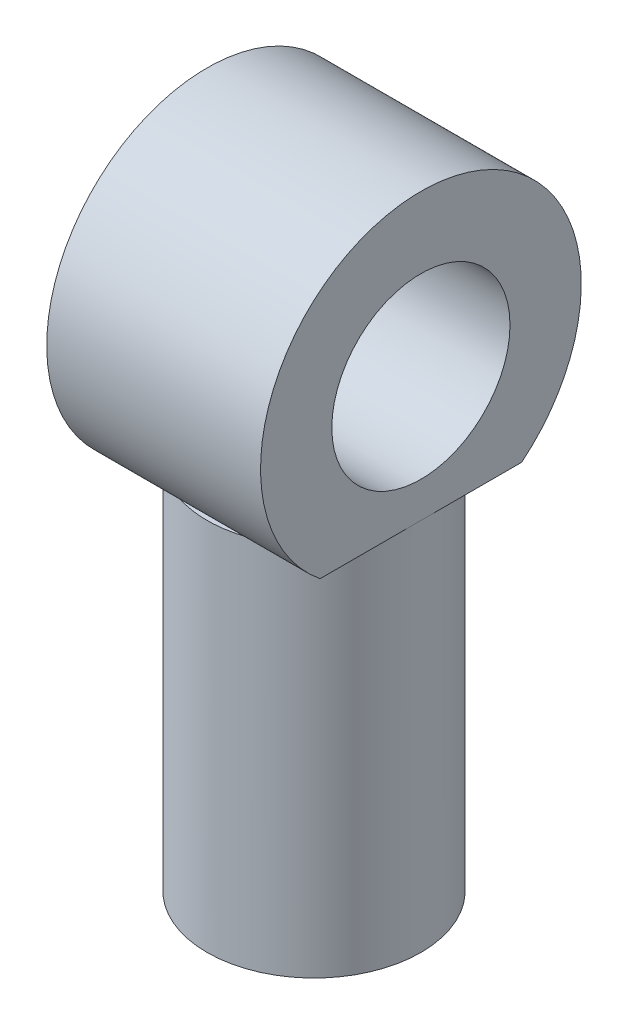
ISO-10303-21;
HEADER;
FILE_DESCRIPTION(('STEP AP214'),'2;1');
FILE_NAME('part.step','',(''),(''),'','','');
FILE_SCHEMA(('AUTOMOTIVE_DESIGN { 1 0 10303 214 1 1 1 1 }'));
ENDSEC;
DATA;
#1=APPLICATION_CONTEXT('core data for automotive mechanical design processes');
#2=APPLICATION_PROTOCOL_DEFINITION('international standard','automotive_design',2000,#1);
#3=PRODUCT_CONTEXT('',#1,'mechanical');
#4=PRODUCT('Part','Part','',(#3));
#5=PRODUCT_RELATED_PRODUCT_CATEGORY('part','',(#4));
#6=PRODUCT_DEFINITION_FORMATION('','',#4);
#7=PRODUCT_DEFINITION_CONTEXT('part definition',#1,'design');
#8=PRODUCT_DEFINITION('design','',#6,#7);
#9=PRODUCT_DEFINITION_SHAPE('','',#8);
#10=(LENGTH_UNIT() NAMED_UNIT(*) SI_UNIT(.MILLI.,.METRE.));
#11=(NAMED_UNIT(*) PLANE_ANGLE_UNIT() SI_UNIT($,.RADIAN.));
#12=(NAMED_UNIT(*) SI_UNIT($,.STERADIAN.) SOLID_ANGLE_UNIT());
#13=UNCERTAINTY_MEASURE_WITH_UNIT(LENGTH_MEASURE(1.E-05),#10,'distance_accuracy_value','');
#14=(GEOMETRIC_REPRESENTATION_CONTEXT(3) GLOBAL_UNCERTAINTY_ASSIGNED_CONTEXT((#13)) GLOBAL_UNIT_ASSIGNED_CONTEXT((#10,
#11,#12)) REPRESENTATION_CONTEXT('',''));
#15=CARTESIAN_POINT('',(0.,0.,0.));
#16=DIRECTION('',(0.,0.,1.));
#17=DIRECTION('',(1.,0.,0.));
#18=AXIS2_PLACEMENT_3D('',#15,#16,#17);
#19=CARTESIAN_POINT('',(0.,10.,0.));
#20=DIRECTION('',(0.,-1.,0.));
#21=DIRECTION('',(0.,0.,-1.));
#22=AXIS2_PLACEMENT_3D('',#19,#20,#21);
#23=CYLINDRICAL_SURFACE('',#22,3.);
#24=CARTESIAN_POINT('',(0.,0.,0.));
#25=DIRECTION('',(0.,1.,0.));
#26=DIRECTION('',(0.,0.,1.));
#27=AXIS2_PLACEMENT_3D('',#24,#25,#26);
#28=CIRCLE('',#27,3.);
#29=CARTESIAN_POINT('',(0.,0.,3.));
#30=VERTEX_POINT('',#29);
#31=EDGE_CURVE('E13',#30,#30,#28,.T.);
#32=ORIENTED_EDGE('',*,*,#31,.T.);
#33=EDGE_LOOP('',(#32));
#34=FACE_BOUND('',#33,.T.);
#35=CARTESIAN_POINT('',(0.,10.5,0.));
#36=DIRECTION('',(0.,1.,0.));
#37=DIRECTION('',(0.,0.,1.));
#38=AXIS2_PLACEMENT_3D('',#35,#36,#37);
#39=CIRCLE('',#38,3.);
#40=CARTESIAN_POINT('',(-0.999999999999999,10.5,2.82842712474619));
#41=VERTEX_POINT('',#40);
#42=CARTESIAN_POINT('',(0.999999999999999,10.5,2.82842712474619));
#43=VERTEX_POINT('',#42);
#44=EDGE_CURVE('E155',#41,#43,#39,.T.);
#45=ORIENTED_EDGE('',*,*,#44,.F.);
#46=CARTESIAN_POINT('',(-3.,10.5,0.));
#47=VERTEX_POINT('',#46);
#48=EDGE_CURVE('E167',#47,#41,#39,.T.);
#49=ORIENTED_EDGE('',*,*,#48,.F.);
#50=CARTESIAN_POINT('',(-0.999999999999992,10.5,-2.82842712474619));
#51=VERTEX_POINT('',#50);
#52=EDGE_CURVE('E391',#51,#47,#39,.T.);
#53=ORIENTED_EDGE('',*,*,#52,.F.);
#54=CARTESIAN_POINT('',(0.999999999999992,10.5,-2.82842712474619));
#55=VERTEX_POINT('',#54);
#56=EDGE_CURVE('E389',#55,#51,#39,.T.);
#57=ORIENTED_EDGE('',*,*,#56,.F.);
#58=CARTESIAN_POINT('',(3.,10.5,0.));
#59=VERTEX_POINT('',#58);
#60=EDGE_CURVE('E157',#59,#55,#39,.T.);
#61=ORIENTED_EDGE('',*,*,#60,.F.);
#62=EDGE_CURVE('E109',#43,#59,#39,.T.);
#63=ORIENTED_EDGE('',*,*,#62,.F.);
#64=EDGE_LOOP('',(#45,#49,#53,#57,#61,#63));
#65=FACE_BOUND('',#64,.T.);
#66=ADVANCED_FACE('F94',(#34,#65),#23,.T.);
#67=CARTESIAN_POINT('',(0.,0.,0.));
#68=DIRECTION('',(0.,1.,0.));
#69=DIRECTION('',(0.,0.,1.));
#70=AXIS2_PLACEMENT_3D('',#67,#68,#69);
#71=PLANE('',#70);
#72=CARTESIAN_POINT('',(0.,0.,0.));
#73=DIRECTION('',(0.,-1.,0.));
#74=DIRECTION('',(0.,0.,-1.));
#75=AXIS2_PLACEMENT_3D('',#72,#73,#74);
#76=CIRCLE('',#75,1.55);
#77=CARTESIAN_POINT('',(0.,0.,-1.55));
#78=VERTEX_POINT('',#77);
#79=EDGE_CURVE('E176',#78,#78,#76,.T.);
#80=ORIENTED_EDGE('',*,*,#79,.F.);
#81=EDGE_LOOP('',(#80));
#82=FACE_BOUND('',#81,.T.);
#83=ORIENTED_EDGE('',*,*,#31,.F.);
#84=EDGE_LOOP('',(#83));
#85=FACE_BOUND('',#84,.T.);
#86=ADVANCED_FACE('F189',(#82,#85),#71,.F.);
#87=CARTESIAN_POINT('',(0.,9.,0.));
#88=DIRECTION('',(0.,-1.,0.));
#89=DIRECTION('',(0.,0.,-1.));
#90=AXIS2_PLACEMENT_3D('',#87,#88,#89);
#91=CYLINDRICAL_SURFACE('',#90,1.55);
#92=CARTESIAN_POINT('',(0.,9.,0.));
#93=DIRECTION('',(0.,-1.,0.));
#94=DIRECTION('',(0.,0.,-1.));
#95=AXIS2_PLACEMENT_3D('',#92,#93,#94);
#96=CIRCLE('',#95,1.55);
#97=CARTESIAN_POINT('',(0.,9.,-1.55));
#98=VERTEX_POINT('',#97);
#99=EDGE_CURVE('E102',#98,#98,#96,.T.);
#100=ORIENTED_EDGE('',*,*,#99,.F.);
#101=EDGE_LOOP('',(#100));
#102=FACE_BOUND('',#101,.T.);
#103=ORIENTED_EDGE('',*,*,#79,.T.);
#104=EDGE_LOOP('',(#103));
#105=FACE_BOUND('',#104,.T.);
#106=ADVANCED_FACE('F187',(#102,#105),#91,.F.);
#107=CARTESIAN_POINT('',(0.,9.,0.));
#108=DIRECTION('',(0.,-1.,0.));
#109=DIRECTION('',(0.,0.,-1.));
#110=AXIS2_PLACEMENT_3D('',#107,#108,#109);
#111=PLANE('',#110);
#112=ORIENTED_EDGE('',*,*,#99,.T.);
#113=EDGE_LOOP('',(#112));
#114=FACE_BOUND('',#113,.T.);
#115=ADVANCED_FACE('F209',(#114),#111,.T.);
#116=CARTESIAN_POINT('',(0.,10.5,0.));
#117=DIRECTION('',(0.,1.,0.));
#118=DIRECTION('',(0.,0.,1.));
#119=AXIS2_PLACEMENT_3D('',#116,#117,#118);
#120=PLANE('',#119);
#121=DIRECTION('',(1.,0.,0.));
#122=VECTOR('',#121,1.);
#123=CARTESIAN_POINT('',(-3.,10.5,-2.82842712474619));
#124=LINE('',#123,#122);
#125=CARTESIAN_POINT('',(-3.,10.5,-2.82842712474619));
#126=VERTEX_POINT('',#125);
#127=EDGE_CURVE('E177',#126,#51,#124,.T.);
#128=ORIENTED_EDGE('',*,*,#127,.T.);
#129=ORIENTED_EDGE('',*,*,#52,.T.);
#130=DIRECTION('',(0.,0.,1.));
#131=VECTOR('',#130,1.);
#132=CARTESIAN_POINT('',(-3.,10.5,0.));
#133=LINE('',#132,#131);
#134=EDGE_CURVE('E150',#126,#47,#133,.T.);
#135=ORIENTED_EDGE('',*,*,#134,.F.);
#136=EDGE_LOOP('',(#128,#129,#135));
#137=FACE_BOUND('',#136,.T.);
#138=ADVANCED_FACE('F217',(#137),#120,.F.);
#139=DIRECTION('',(1.,0.,0.));
#140=VECTOR('',#139,1.);
#141=CARTESIAN_POINT('',(-3.,10.5,2.82842712474619));
#142=LINE('',#141,#140);
#143=CARTESIAN_POINT('',(-3.,10.5,2.82842712474619));
#144=VERTEX_POINT('',#143);
#145=EDGE_CURVE('E117',#144,#41,#142,.T.);
#146=ORIENTED_EDGE('',*,*,#145,.F.);
#147=EDGE_CURVE('E359',#47,#144,#133,.T.);
#148=ORIENTED_EDGE('',*,*,#147,.F.);
#149=ORIENTED_EDGE('',*,*,#48,.T.);
#150=EDGE_LOOP('',(#146,#148,#149));
#151=FACE_BOUND('',#150,.T.);
#152=ADVANCED_FACE('F224',(#151),#120,.F.);
#153=DIRECTION('',(1.,0.,0.));
#154=VECTOR('',#153,1.);
#155=CARTESIAN_POINT('',(-3.,10.5,2.82842712474619));
#156=LINE('',#155,#154);
#157=CARTESIAN_POINT('',(3.,10.5,2.82842712474619));
#158=VERTEX_POINT('',#157);
#159=EDGE_CURVE('E140',#158,#43,#156,.F.);
#160=ORIENTED_EDGE('',*,*,#159,.T.);
#161=ORIENTED_EDGE('',*,*,#62,.T.);
#162=DIRECTION('',(0.,0.,1.));
#163=VECTOR('',#162,1.);
#164=CARTESIAN_POINT('',(3.,10.5,0.));
#165=LINE('',#164,#163);
#166=EDGE_CURVE('E143',#59,#158,#165,.T.);
#167=ORIENTED_EDGE('',*,*,#166,.T.);
#168=EDGE_LOOP('',(#160,#161,#167));
#169=FACE_BOUND('',#168,.T.);
#170=ADVANCED_FACE('F141',(#169),#120,.F.);
#171=CARTESIAN_POINT('',(3.,10.5,-2.82842712474619));
#172=VERTEX_POINT('',#171);
#173=EDGE_CURVE('E382',#172,#59,#165,.T.);
#174=ORIENTED_EDGE('',*,*,#173,.T.);
#175=ORIENTED_EDGE('',*,*,#60,.T.);
#176=DIRECTION('',(1.,0.,0.));
#177=VECTOR('',#176,1.);
#178=CARTESIAN_POINT('',(-3.,10.5,-2.82842712474619));
#179=LINE('',#178,#177);
#180=EDGE_CURVE('E166',#55,#172,#179,.T.);
#181=ORIENTED_EDGE('',*,*,#180,.T.);
#182=EDGE_LOOP('',(#174,#175,#181));
#183=FACE_BOUND('',#182,.T.);
#184=ADVANCED_FACE('F227',(#183),#120,.F.);
#185=CARTESIAN_POINT('',(-3.,14.,0.));
#186=DIRECTION('',(1.,0.,0.));
#187=DIRECTION('',(0.,0.,-1.));
#188=AXIS2_PLACEMENT_3D('',#185,#186,#187);
#189=CYLINDRICAL_SURFACE('',#188,2.5);
#190=CARTESIAN_POINT('',(-3.,14.,0.));
#191=DIRECTION('',(1.,0.,0.));
#192=DIRECTION('',(0.,0.,-1.));
#193=AXIS2_PLACEMENT_3D('',#190,#191,#192);
#194=CIRCLE('',#193,2.5);
#195=CARTESIAN_POINT('',(-3.,14.,-2.5));
#196=VERTEX_POINT('',#195);
#197=EDGE_CURVE('E356',#196,#196,#194,.T.);
#198=ORIENTED_EDGE('',*,*,#197,.F.);
#199=EDGE_LOOP('',(#198));
#200=FACE_BOUND('',#199,.T.);
#201=CARTESIAN_POINT('',(3.,14.,0.));
#202=DIRECTION('',(1.,0.,0.));
#203=DIRECTION('',(0.,0.,-1.));
#204=AXIS2_PLACEMENT_3D('',#201,#202,#203);
#205=CIRCLE('',#204,2.5);
#206=CARTESIAN_POINT('',(3.,14.,-2.5));
#207=VERTEX_POINT('',#206);
#208=EDGE_CURVE('E149',#207,#207,#205,.T.);
#209=ORIENTED_EDGE('',*,*,#208,.T.);
#210=EDGE_LOOP('',(#209));
#211=FACE_BOUND('',#210,.T.);
#212=ADVANCED_FACE('F243',(#200,#211),#189,.F.);
#213=CARTESIAN_POINT('',(3.,10.5,0.));
#214=DIRECTION('',(0.,1.,0.));
#215=DIRECTION('',(0.,0.,1.));
#216=AXIS2_PLACEMENT_3D('',#213,#214,#215);
#217=PLANE('',#216);
#218=ORIENTED_EDGE('',*,*,#56,.T.);
#219=EDGE_CURVE('E364',#51,#55,#124,.T.);
#220=ORIENTED_EDGE('',*,*,#219,.T.);
#221=EDGE_LOOP('',(#218,#220));
#222=FACE_BOUND('',#221,.T.);
#223=ADVANCED_FACE('F250',(#222),#217,.T.);
#224=CARTESIAN_POINT('',(3.,0.,0.));
#225=DIRECTION('',(1.,0.,0.));
#226=DIRECTION('',(0.,0.,-1.));
#227=AXIS2_PLACEMENT_3D('',#224,#225,#226);
#228=PLANE('',#227);
#229=ORIENTED_EDGE('',*,*,#173,.F.);
#230=CARTESIAN_POINT('',(3.,14.,0.));
#231=DIRECTION('',(1.,0.,0.));
#232=DIRECTION('',(0.,0.,-1.));
#233=AXIS2_PLACEMENT_3D('',#230,#231,#232);
#234=CIRCLE('',#233,4.5);
#235=EDGE_CURVE('E369',#172,#158,#234,.T.);
#236=ORIENTED_EDGE('',*,*,#235,.T.);
#237=ORIENTED_EDGE('',*,*,#166,.F.);
#238=EDGE_LOOP('',(#229,#236,#237));
#239=FACE_BOUND('',#238,.T.);
#240=ORIENTED_EDGE('',*,*,#208,.F.);
#241=EDGE_LOOP('',(#240));
#242=FACE_BOUND('',#241,.T.);
#243=ADVANCED_FACE('F257',(#239,#242),#228,.T.);
#244=CARTESIAN_POINT('',(-3.,0.,0.));
#245=DIRECTION('',(1.,0.,0.));
#246=DIRECTION('',(0.,0.,-1.));
#247=AXIS2_PLACEMENT_3D('',#244,#245,#246);
#248=PLANE('',#247);
#249=ORIENTED_EDGE('',*,*,#197,.T.);
#250=EDGE_LOOP('',(#249));
#251=FACE_BOUND('',#250,.T.);
#252=CARTESIAN_POINT('',(-3.,14.,0.));
#253=DIRECTION('',(1.,0.,0.));
#254=DIRECTION('',(0.,0.,-1.));
#255=AXIS2_PLACEMENT_3D('',#252,#253,#254);
#256=CIRCLE('',#255,4.5);
#257=EDGE_CURVE('E172',#126,#144,#256,.T.);
#258=ORIENTED_EDGE('',*,*,#257,.F.);
#259=ORIENTED_EDGE('',*,*,#134,.T.);
#260=ORIENTED_EDGE('',*,*,#147,.T.);
#261=EDGE_LOOP('',(#258,#259,#260));
#262=FACE_BOUND('',#261,.T.);
#263=ADVANCED_FACE('F265',(#251,#262),#248,.F.);
#264=CARTESIAN_POINT('',(-3.,14.,0.));
#265=DIRECTION('',(1.,0.,0.));
#266=DIRECTION('',(0.,0.,-1.));
#267=AXIS2_PLACEMENT_3D('',#264,#265,#266);
#268=CYLINDRICAL_SURFACE('',#267,4.5);
#269=ORIENTED_EDGE('',*,*,#127,.F.);
#270=ORIENTED_EDGE('',*,*,#257,.T.);
#271=ORIENTED_EDGE('',*,*,#145,.T.);
#272=EDGE_CURVE('E164',#41,#43,#142,.T.);
#273=ORIENTED_EDGE('',*,*,#272,.T.);
#274=ORIENTED_EDGE('',*,*,#159,.F.);
#275=ORIENTED_EDGE('',*,*,#235,.F.);
#276=ORIENTED_EDGE('',*,*,#180,.F.);
#277=ORIENTED_EDGE('',*,*,#219,.F.);
#278=EDGE_LOOP('',(#269,#270,#271,#273,#274,#275,#276,#277));
#279=FACE_BOUND('',#278,.T.);
#280=ADVANCED_FACE('F169',(#279),#268,.T.);
#281=CARTESIAN_POINT('',(-3.,10.5,0.));
#282=DIRECTION('',(0.,-1.,0.));
#283=DIRECTION('',(0.,0.,-1.));
#284=AXIS2_PLACEMENT_3D('',#281,#282,#283);
#285=PLANE('',#284);
#286=ORIENTED_EDGE('',*,*,#272,.F.);
#287=ORIENTED_EDGE('',*,*,#44,.T.);
#288=EDGE_LOOP('',(#286,#287));
#289=FACE_BOUND('',#288,.T.);
#290=ADVANCED_FACE('F163',(#289),#285,.F.);
#291=CLOSED_SHELL('',(#66,#86,#106,#115,#138,#152,#170,#184,#212,#223,#243,#263,#280,#290));
#292=MANIFOLD_SOLID_BREP('B2',#291);
#293=ADVANCED_BREP_SHAPE_REPRESENTATION('',(#18,#292),#14);
#294=SHAPE_DEFINITION_REPRESENTATION(#9,#293);
ENDSEC;
END-ISO-10303-21;
